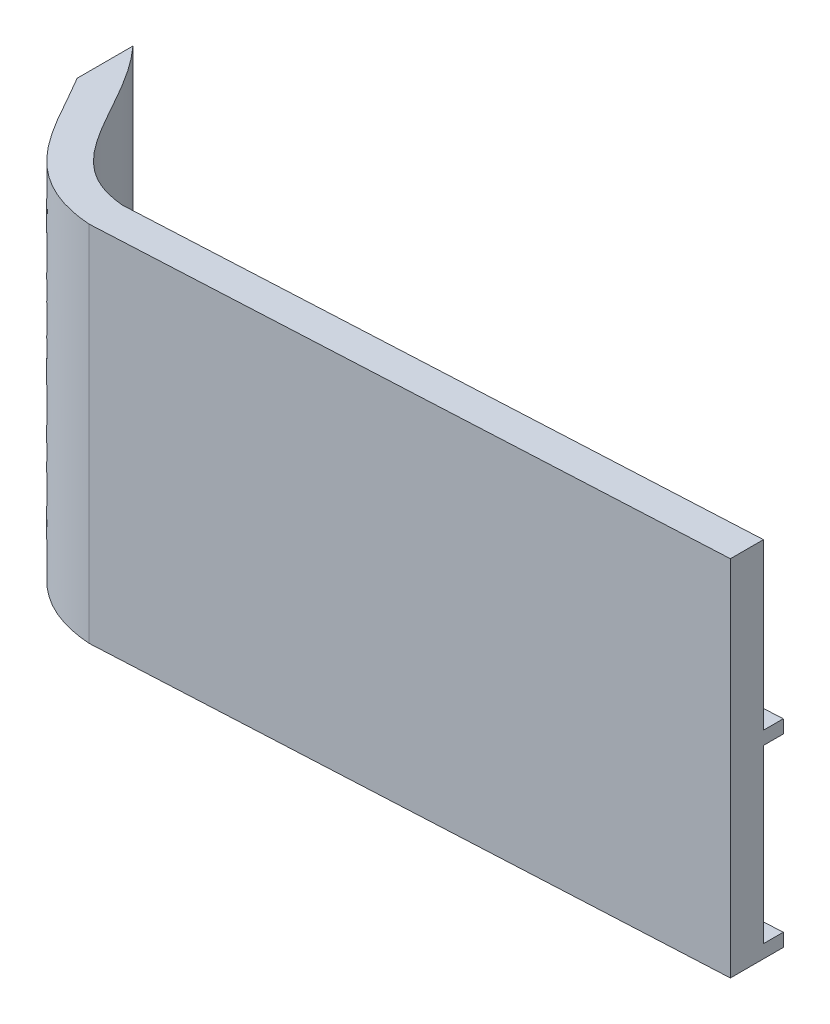
ISO-10303-21;
HEADER;
FILE_DESCRIPTION(('STEP AP214'),'2;1');
FILE_NAME('part.step','',(''),(''),'','','');
FILE_SCHEMA(('AUTOMOTIVE_DESIGN { 1 0 10303 214 1 1 1 1 }'));
ENDSEC;
DATA;
#1=APPLICATION_CONTEXT('core data for automotive mechanical design processes');
#2=APPLICATION_PROTOCOL_DEFINITION('international standard','automotive_design',2000,#1);
#3=PRODUCT_CONTEXT('',#1,'mechanical');
#4=PRODUCT('Part','Part','',(#3));
#5=PRODUCT_RELATED_PRODUCT_CATEGORY('part','',(#4));
#6=PRODUCT_DEFINITION_FORMATION('','',#4);
#7=PRODUCT_DEFINITION_CONTEXT('part definition',#1,'design');
#8=PRODUCT_DEFINITION('design','',#6,#7);
#9=PRODUCT_DEFINITION_SHAPE('','',#8);
#10=(LENGTH_UNIT() NAMED_UNIT(*) SI_UNIT(.MILLI.,.METRE.));
#11=(NAMED_UNIT(*) PLANE_ANGLE_UNIT() SI_UNIT($,.RADIAN.));
#12=(NAMED_UNIT(*) SI_UNIT($,.STERADIAN.) SOLID_ANGLE_UNIT());
#13=UNCERTAINTY_MEASURE_WITH_UNIT(LENGTH_MEASURE(1.E-05),#10,'distance_accuracy_value','');
#14=(GEOMETRIC_REPRESENTATION_CONTEXT(3) GLOBAL_UNCERTAINTY_ASSIGNED_CONTEXT((#13)) GLOBAL_UNIT_ASSIGNED_CONTEXT((#10,
#11,#12)) REPRESENTATION_CONTEXT('',''));
#15=CARTESIAN_POINT('',(0.,0.,0.));
#16=DIRECTION('',(0.,0.,1.));
#17=DIRECTION('',(1.,0.,0.));
#18=AXIS2_PLACEMENT_3D('',#15,#16,#17);
#19=CARTESIAN_POINT('',(15.2026066350711,-55.02,-53.3815975655058));
#20=DIRECTION('',(-1.,0.,0.));
#21=DIRECTION('',(0.,0.,1.));
#22=AXIS2_PLACEMENT_3D('',#19,#20,#21);
#23=PLANE('',#22);
#24=DIRECTION('',(0.,-1.,0.));
#25=VECTOR('',#24,1.);
#26=CARTESIAN_POINT('',(15.2026066350711,-55.,62.2678534896764));
#27=LINE('',#26,#25);
#28=CARTESIAN_POINT('',(15.2026066350711,0.,62.2678534896764));
#29=VERTEX_POINT('',#28);
#30=CARTESIAN_POINT('',(15.2026066350711,-55.,62.2678534896764));
#31=VERTEX_POINT('',#30);
#32=EDGE_CURVE('E249',#29,#31,#27,.T.);
#33=ORIENTED_EDGE('',*,*,#32,.T.);
#34=DIRECTION('',(0.,0.,-1.));
#35=VECTOR('',#34,1.);
#36=CARTESIAN_POINT('',(15.2026066350711,-55.,32.5431279620853));
#37=LINE('',#36,#35);
#38=CARTESIAN_POINT('',(15.2026066350711,-55.,54.2576414228439));
#39=VERTEX_POINT('',#38);
#40=EDGE_CURVE('E252',#31,#39,#37,.T.);
#41=ORIENTED_EDGE('',*,*,#40,.T.);
#42=DIRECTION('',(0.,-1.,0.));
#43=VECTOR('',#42,1.);
#44=CARTESIAN_POINT('',(15.2026066350711,0.,54.2576414228439));
#45=LINE('',#44,#43);
#46=CARTESIAN_POINT('',(15.2026066350711,-53.,54.2576414228439));
#47=VERTEX_POINT('',#46);
#48=EDGE_CURVE('E211',#47,#39,#45,.T.);
#49=ORIENTED_EDGE('',*,*,#48,.F.);
#50=DIRECTION('',(0.,0.,-1.));
#51=VECTOR('',#50,1.);
#52=CARTESIAN_POINT('',(15.2026066350711,-53.,54.7700862993215));
#53=LINE('',#52,#51);
#54=CARTESIAN_POINT('',(15.2026066350711,-53.,57.2614709479061));
#55=VERTEX_POINT('',#54);
#56=EDGE_CURVE('E248',#55,#47,#53,.T.);
#57=ORIENTED_EDGE('',*,*,#56,.F.);
#58=DIRECTION('',(0.,-1.,0.));
#59=VECTOR('',#58,1.);
#60=CARTESIAN_POINT('',(15.2026066350711,-55.,57.261470947906));
#61=LINE('',#60,#59);
#62=CARTESIAN_POINT('',(15.2026066350711,-27.,57.261470947906));
#63=VERTEX_POINT('',#62);
#64=EDGE_CURVE('E154',#63,#55,#61,.T.);
#65=ORIENTED_EDGE('',*,*,#64,.F.);
#66=DIRECTION('',(0.,0.,-1.));
#67=VECTOR('',#66,1.);
#68=CARTESIAN_POINT('',(15.2026066350711,-27.,54.7700862993215));
#69=LINE('',#68,#67);
#70=CARTESIAN_POINT('',(15.2026066350711,-27.,54.2576414228439));
#71=VERTEX_POINT('',#70);
#72=EDGE_CURVE('E43',#63,#71,#69,.T.);
#73=ORIENTED_EDGE('',*,*,#72,.T.);
#74=DIRECTION('',(0.,1.,0.));
#75=VECTOR('',#74,1.);
#76=CARTESIAN_POINT('',(15.2026066350711,0.,54.2576414228439));
#77=LINE('',#76,#75);
#78=CARTESIAN_POINT('',(15.2026066350711,-25.,54.2576414228439));
#79=VERTEX_POINT('',#78);
#80=EDGE_CURVE('E11',#71,#79,#77,.T.);
#81=ORIENTED_EDGE('',*,*,#80,.T.);
#82=DIRECTION('',(0.,0.,-1.));
#83=VECTOR('',#82,1.);
#84=CARTESIAN_POINT('',(15.2026066350711,-25.,54.7700862993215));
#85=LINE('',#84,#83);
#86=CARTESIAN_POINT('',(15.2026066350711,-25.,57.261470947906));
#87=VERTEX_POINT('',#86);
#88=EDGE_CURVE('E51',#87,#79,#85,.T.);
#89=ORIENTED_EDGE('',*,*,#88,.F.);
#90=CARTESIAN_POINT('',(15.2026066350711,0.,57.261470947906));
#91=VERTEX_POINT('',#90);
#92=EDGE_CURVE('E253',#91,#87,#61,.T.);
#93=ORIENTED_EDGE('',*,*,#92,.F.);
#94=DIRECTION('',(0.,0.,-1.));
#95=VECTOR('',#94,1.);
#96=CARTESIAN_POINT('',(15.2026066350711,0.,32.5431279620853));
#97=LINE('',#96,#95);
#98=EDGE_CURVE('E38',#29,#91,#97,.T.);
#99=ORIENTED_EDGE('',*,*,#98,.F.);
#100=EDGE_LOOP('',(#33,#41,#49,#57,#65,#73,#81,#89,#93,#99));
#101=FACE_BOUND('',#100,.T.);
#102=ADVANCED_FACE('F35',(#101),#23,.F.);
#103=CARTESIAN_POINT('',(-77.2973933649289,-55.,66.9431279620853));
#104=DIRECTION('',(0.0504790708541747,0.,0.998725119042121));
#105=DIRECTION('',(0.998725119042121,0.,-0.0504790708541747));
#106=AXIS2_PLACEMENT_3D('',#103,#104,#105);
#107=PLANE('',#106);
#108=ORIENTED_EDGE('',*,*,#32,.F.);
#109=DIRECTION('',(0.998725119042121,0.,-0.0504790708541747));
#110=VECTOR('',#109,1.);
#111=CARTESIAN_POINT('',(-77.2973933649289,0.,66.9431279620853));
#112=LINE('',#111,#110);
#113=CARTESIAN_POINT('',(-77.2973933649289,0.,66.9431279620853));
#114=VERTEX_POINT('',#113);
#115=EDGE_CURVE('E198',#114,#29,#112,.T.);
#116=ORIENTED_EDGE('',*,*,#115,.F.);
#117=DIRECTION('',(0.,1.,0.));
#118=VECTOR('',#117,1.);
#119=CARTESIAN_POINT('',(-77.2973933649289,-55.,66.9431279620853));
#120=LINE('',#119,#118);
#121=CARTESIAN_POINT('',(-77.2973933649289,-55.,66.9431279620853));
#122=VERTEX_POINT('',#121);
#123=EDGE_CURVE('E310',#122,#114,#120,.T.);
#124=ORIENTED_EDGE('',*,*,#123,.F.);
#125=DIRECTION('',(0.998725119042121,0.,-0.0504790708541747));
#126=VECTOR('',#125,1.);
#127=CARTESIAN_POINT('',(-77.2973933649289,-55.,66.9431279620853));
#128=LINE('',#127,#126);
#129=EDGE_CURVE('E193',#122,#31,#128,.T.);
#130=ORIENTED_EDGE('',*,*,#129,.T.);
#131=EDGE_LOOP('',(#108,#116,#124,#130));
#132=FACE_BOUND('',#131,.T.);
#133=ADVANCED_FACE('F328',(#132),#107,.T.);
#134=CARTESIAN_POINT('',(-77.2198387862858,-55.,61.9328255398636));
#135=DIRECTION('',(0.0504790708541748,0.,0.998725119042121));
#136=DIRECTION('',(0.998725119042121,0.,-0.0504790708541748));
#137=AXIS2_PLACEMENT_3D('',#134,#135,#136);
#138=PLANE('',#137);
#139=DIRECTION('',(0.998725119042121,0.,-0.0504790708541748));
#140=VECTOR('',#139,1.);
#141=CARTESIAN_POINT('',(-77.2198387862858,0.,61.9328255398636));
#142=LINE('',#141,#140);
#143=CARTESIAN_POINT('',(-77.2198387862858,0.,61.9328255398636));
#144=VERTEX_POINT('',#143);
#145=EDGE_CURVE('E197',#144,#91,#142,.T.);
#146=ORIENTED_EDGE('',*,*,#145,.T.);
#147=ORIENTED_EDGE('',*,*,#92,.T.);
#148=DIRECTION('',(0.998725119042121,0.,-0.0504790708541748));
#149=VECTOR('',#148,1.);
#150=CARTESIAN_POINT('',(-77.2198387862858,-25.,61.9328255398636));
#151=LINE('',#150,#149);
#152=CARTESIAN_POINT('',(5.21535544464991,-25.,57.7662616564478));
#153=VERTEX_POINT('',#152);
#154=EDGE_CURVE('E209',#153,#87,#151,.T.);
#155=ORIENTED_EDGE('',*,*,#154,.F.);
#156=DIRECTION('',(0.,1.,0.));
#157=VECTOR('',#156,1.);
#158=CARTESIAN_POINT('',(5.21535544464991,-27.,57.7662616564478));
#159=LINE('',#158,#157);
#160=CARTESIAN_POINT('',(5.21535544464991,-27.,57.7662616564478));
#161=VERTEX_POINT('',#160);
#162=EDGE_CURVE('E179',#161,#153,#159,.T.);
#163=ORIENTED_EDGE('',*,*,#162,.F.);
#164=DIRECTION('',(0.998725119042121,0.,-0.0504790708541748));
#165=VECTOR('',#164,1.);
#166=CARTESIAN_POINT('',(-77.2198387862858,-27.,61.9328255398636));
#167=LINE('',#166,#165);
#168=EDGE_CURVE('E207',#161,#63,#167,.T.);
#169=ORIENTED_EDGE('',*,*,#168,.T.);
#170=ORIENTED_EDGE('',*,*,#64,.T.);
#171=DIRECTION('',(0.998725119042121,0.,-0.0504790708541747));
#172=VECTOR('',#171,1.);
#173=CARTESIAN_POINT('',(5.21535544464991,-53.,57.7662616564478));
#174=LINE('',#173,#172);
#175=CARTESIAN_POINT('',(5.21535544464991,-53.,57.7662616564478));
#176=VERTEX_POINT('',#175);
#177=EDGE_CURVE('E135',#176,#55,#174,.T.);
#178=ORIENTED_EDGE('',*,*,#177,.F.);
#179=DIRECTION('',(0.,-1.,0.));
#180=VECTOR('',#179,1.);
#181=CARTESIAN_POINT('',(5.21535544464991,-53.,57.7662616564478));
#182=LINE('',#181,#180);
#183=CARTESIAN_POINT('',(5.21535544464991,-55.,57.7662616564478));
#184=VERTEX_POINT('',#183);
#185=EDGE_CURVE('E144',#176,#184,#182,.T.);
#186=ORIENTED_EDGE('',*,*,#185,.T.);
#187=DIRECTION('',(0.998725119042121,0.,-0.0504790708541748));
#188=VECTOR('',#187,1.);
#189=CARTESIAN_POINT('',(-77.2198387862858,-55.,61.9328255398636));
#190=LINE('',#189,#188);
#191=CARTESIAN_POINT('',(-77.2198387862858,-55.,61.9328255398636));
#192=VERTEX_POINT('',#191);
#193=EDGE_CURVE('E194',#192,#184,#190,.T.);
#194=ORIENTED_EDGE('',*,*,#193,.F.);
#195=DIRECTION('',(0.,1.,0.));
#196=VECTOR('',#195,1.);
#197=CARTESIAN_POINT('',(-77.2198387862858,-55.,61.9328255398636));
#198=LINE('',#197,#196);
#199=EDGE_CURVE('E264',#192,#144,#198,.T.);
#200=ORIENTED_EDGE('',*,*,#199,.T.);
#201=EDGE_LOOP('',(#146,#147,#155,#163,#169,#170,#178,#186,#194,#200));
#202=FACE_BOUND('',#201,.T.);
#203=ADVANCED_FACE('F151',(#202),#138,.F.);
#204=CARTESIAN_POINT('',(5.06391823208739,-53.,54.7700862993215));
#205=DIRECTION('',(-0.998725119042121,0.,0.0504790708541748));
#206=DIRECTION('',(0.0504790708541748,0.,0.998725119042121));
#207=AXIS2_PLACEMENT_3D('',#204,#205,#206);
#208=PLANE('',#207);
#209=ORIENTED_EDGE('',*,*,#185,.F.);
#210=DIRECTION('',(0.0504790708541748,0.,0.998725119042121));
#211=VECTOR('',#210,1.);
#212=CARTESIAN_POINT('',(5.06391823208739,-53.,54.7700862993215));
#213=LINE('',#212,#211);
#214=CARTESIAN_POINT('',(5.06391823208739,-53.,54.7700862993215));
#215=VERTEX_POINT('',#214);
#216=EDGE_CURVE('E131',#215,#176,#213,.T.);
#217=ORIENTED_EDGE('',*,*,#216,.F.);
#218=DIRECTION('',(0.,-1.,0.));
#219=VECTOR('',#218,1.);
#220=CARTESIAN_POINT('',(5.06391823208739,-53.,54.7700862993215));
#221=LINE('',#220,#219);
#222=CARTESIAN_POINT('',(5.06391823208739,-55.,54.7700862993215));
#223=VERTEX_POINT('',#222);
#224=EDGE_CURVE('E156',#215,#223,#221,.T.);
#225=ORIENTED_EDGE('',*,*,#224,.T.);
#226=DIRECTION('',(0.0504790708541748,0.,0.998725119042121));
#227=VECTOR('',#226,1.);
#228=CARTESIAN_POINT('',(5.06391823208739,-55.,54.7700862993215));
#229=LINE('',#228,#227);
#230=EDGE_CURVE('E141',#223,#184,#229,.T.);
#231=ORIENTED_EDGE('',*,*,#230,.T.);
#232=EDGE_LOOP('',(#209,#217,#225,#231));
#233=FACE_BOUND('',#232,.T.);
#234=ADVANCED_FACE('F145',(#233),#208,.T.);
#235=CARTESIAN_POINT('',(-115.897393364929,-55.,32.5431279620853));
#236=DIRECTION('',(0.,-1.,0.));
#237=DIRECTION('',(0.,0.,-1.));
#238=AXIS2_PLACEMENT_3D('',#235,#236,#237);
#239=PLANE('',#238);
#240=ORIENTED_EDGE('',*,*,#40,.F.);
#241=ORIENTED_EDGE('',*,*,#129,.F.);
#242=CARTESIAN_POINT('',(-112.297393364929,-55.,37.9431279620853));
#243=CARTESIAN_POINT('',(-92.6699085338428,-55.,40.1856361833209));
#244=CARTESIAN_POINT('',(-97.4782956804952,-55.,65.4447991108473));
#245=CARTESIAN_POINT('',(-77.2973933649289,-55.,66.9431279620853));
#246=B_SPLINE_CURVE_WITH_KNOTS('',3,(#242,#243,#244,#245),.UNSPECIFIED.,.F.,.F.,(4,4),(0.,1.),.UNSPECIFIED.);
#247=CARTESIAN_POINT('',(-97.2973933577952,-55.,48.7098659324555));
#248=VERTEX_POINT('',#247);
#249=EDGE_CURVE('E301',#248,#122,#246,.T.);
#250=ORIENTED_EDGE('',*,*,#249,.F.);
#251=DIRECTION('',(0.,0.,-1.));
#252=VECTOR('',#251,1.);
#253=CARTESIAN_POINT('',(-97.2973933577951,-55.,32.5431279620854));
#254=LINE('',#253,#252);
#255=CARTESIAN_POINT('',(-97.2973933649289,-55.,40.2586431743358));
#256=VERTEX_POINT('',#255);
#257=EDGE_CURVE('E168',#248,#256,#254,.T.);
#258=ORIENTED_EDGE('',*,*,#257,.T.);
#259=CARTESIAN_POINT('',(-77.2198387862858,-55.,61.9328255398636));
#260=CARTESIAN_POINT('',(-78.2107017584619,-55.,61.8435846098282));
#261=CARTESIAN_POINT('',(-79.1969605229184,-55.,61.6726700387196));
#262=CARTESIAN_POINT('',(-80.6118955307622,-55.,61.2559322589059));
#263=CARTESIAN_POINT('',(-81.0738075363474,-55.,61.0902721397558));
#264=CARTESIAN_POINT('',(-81.9757491725826,-55.,60.698816324706));
#265=CARTESIAN_POINT('',(-82.4171226794675,-55.,60.4721016558839));
#266=CARTESIAN_POINT('',(-83.6970629718621,-55.,59.6999601025132));
#267=CARTESIAN_POINT('',(-84.461423347136,-55.,59.0809836088541));
#268=CARTESIAN_POINT('',(-85.5106781349921,-55.,58.0385154706328));
#269=CARTESIAN_POINT('',(-85.8453115285959,-55.,57.6709972577795));
#270=CARTESIAN_POINT('',(-86.4839082331669,-55.,56.9114729422574));
#271=CARTESIAN_POINT('',(-86.7871648693087,-55.,56.5206426243169));
#272=CARTESIAN_POINT('',(-87.6614057532498,-55.,55.3236380255405));
#273=CARTESIAN_POINT('',(-88.1973862119224,-55.,54.493312491717));
#274=CARTESIAN_POINT('',(-89.2240136923505,-55.,52.8013831158895));
#275=CARTESIAN_POINT('',(-89.7142600627695,-55.,51.9396796712163));
#276=CARTESIAN_POINT('',(-91.1675589427809,-55.,49.344344007152));
#277=CARTESIAN_POINT('',(-92.1149811469364,-55.,47.6003319069548));
#278=CARTESIAN_POINT('',(-94.1801021089176,-55.,44.2217956485791));
#279=CARTESIAN_POINT('',(-95.2960430904192,-55.,42.5861412390059));
#280=CARTESIAN_POINT('',(-96.8184655607454,-55.,40.791519394526));
#281=CARTESIAN_POINT('',(-97.055392698968,-55.,40.5225433078804));
#282=CARTESIAN_POINT('',(-97.2973933649289,-55.,40.2586431743359));
#283=B_SPLINE_CURVE_WITH_KNOTS('',3,(#259,#260,#261,#262,#263,#264,#265,#266,#267,#268,#269,
#270,#271,#272,#273,#274,#275,#276,#277,#278,#279,#280,#281,#282),.UNSPECIFIED.,.F.,.F.,(4,2,2,
2,2,2,2,2,2,2,2,4),(0.352672192174137,0.415172192174137,0.446422192174137,0.477672192174137,
0.540172192174136,0.571422192174136,0.602672192174136,0.665172192174136,0.727672192174136,
0.852672192174136,0.977672192174136,1.),.UNSPECIFIED.);
#284=EDGE_CURVE('E271',#256,#192,#283,.F.);
#285=ORIENTED_EDGE('',*,*,#284,.T.);
#286=ORIENTED_EDGE('',*,*,#193,.T.);
#287=ORIENTED_EDGE('',*,*,#230,.F.);
#288=DIRECTION('',(0.998725119042121,0.,-0.0504790708541747));
#289=VECTOR('',#288,1.);
#290=CARTESIAN_POINT('',(5.06391823208739,-55.,54.7700862993215));
#291=LINE('',#290,#289);
#292=EDGE_CURVE('E158',#223,#39,#291,.T.);
#293=ORIENTED_EDGE('',*,*,#292,.T.);
#294=EDGE_LOOP('',(#240,#241,#250,#258,#285,#286,#287,#293));
#295=FACE_BOUND('',#294,.T.);
#296=ADVANCED_FACE('F233',(#295),#239,.T.);
#297=CARTESIAN_POINT('',(5.06391823208739,-53.,54.7700862993215));
#298=DIRECTION('',(0.,-1.,0.));
#299=DIRECTION('',(0.,0.,-1.));
#300=AXIS2_PLACEMENT_3D('',#297,#298,#299);
#301=PLANE('',#300);
#302=ORIENTED_EDGE('',*,*,#177,.T.);
#303=ORIENTED_EDGE('',*,*,#56,.T.);
#304=DIRECTION('',(0.998725119042121,0.,-0.0504790708541747));
#305=VECTOR('',#304,1.);
#306=CARTESIAN_POINT('',(5.06391823208739,-53.,54.7700862993215));
#307=LINE('',#306,#305);
#308=EDGE_CURVE('E137',#215,#47,#307,.T.);
#309=ORIENTED_EDGE('',*,*,#308,.F.);
#310=ORIENTED_EDGE('',*,*,#216,.T.);
#311=EDGE_LOOP('',(#302,#303,#309,#310));
#312=FACE_BOUND('',#311,.T.);
#313=ADVANCED_FACE('F133',(#312),#301,.F.);
#314=CARTESIAN_POINT('',(2.77412190406091,0.,54.88582063791));
#315=DIRECTION('',(0.0504790708541748,0.,0.998725119042121));
#316=DIRECTION('',(0.998725119042121,0.,-0.0504790708541748));
#317=AXIS2_PLACEMENT_3D('',#314,#315,#316);
#318=PLANE('',#317);
#319=ORIENTED_EDGE('',*,*,#308,.T.);
#320=ORIENTED_EDGE('',*,*,#48,.T.);
#321=ORIENTED_EDGE('',*,*,#292,.F.);
#322=ORIENTED_EDGE('',*,*,#224,.F.);
#323=EDGE_LOOP('',(#319,#320,#321,#322));
#324=FACE_BOUND('',#323,.T.);
#325=ADVANCED_FACE('F232',(#324),#318,.F.);
#326=CARTESIAN_POINT('',(-115.897393364929,0.,32.5431279620853));
#327=DIRECTION('',(0.,-1.,0.));
#328=DIRECTION('',(0.,0.,-1.));
#329=AXIS2_PLACEMENT_3D('',#326,#327,#328);
#330=PLANE('',#329);
#331=ORIENTED_EDGE('',*,*,#115,.T.);
#332=ORIENTED_EDGE('',*,*,#98,.T.);
#333=ORIENTED_EDGE('',*,*,#145,.F.);
#334=CARTESIAN_POINT('',(-97.2973933649289,0.,40.2586431743359));
#335=CARTESIAN_POINT('',(-97.055392698968,0.,40.5225433078804));
#336=CARTESIAN_POINT('',(-96.8184655607454,0.,40.791519394526));
#337=CARTESIAN_POINT('',(-95.2960430904192,0.,42.5861412390059));
#338=CARTESIAN_POINT('',(-94.1801021089176,0.,44.2217956485791));
#339=CARTESIAN_POINT('',(-92.1149811469364,0.,47.6003319069548));
#340=CARTESIAN_POINT('',(-91.1675589427809,0.,49.344344007152));
#341=CARTESIAN_POINT('',(-89.7142600627695,0.,51.9396796712163));
#342=CARTESIAN_POINT('',(-89.2240136923505,0.,52.8013831158895));
#343=CARTESIAN_POINT('',(-88.1973862119224,0.,54.493312491717));
#344=CARTESIAN_POINT('',(-87.6614057532498,0.,55.3236380255405));
#345=CARTESIAN_POINT('',(-86.7871648693087,0.,56.5206426243169));
#346=CARTESIAN_POINT('',(-86.4839082331669,0.,56.9114729422574));
#347=CARTESIAN_POINT('',(-85.8453115285959,0.,57.6709972577795));
#348=CARTESIAN_POINT('',(-85.5106781349921,0.,58.0385154706328));
#349=CARTESIAN_POINT('',(-84.461423347136,0.,59.0809836088541));
#350=CARTESIAN_POINT('',(-83.6970629718621,0.,59.6999601025132));
#351=CARTESIAN_POINT('',(-82.4171226794675,0.,60.4721016558839));
#352=CARTESIAN_POINT('',(-81.9757491725826,0.,60.698816324706));
#353=CARTESIAN_POINT('',(-81.0738075363474,0.,61.0902721397558));
#354=CARTESIAN_POINT('',(-80.6118955307622,0.,61.2559322589059));
#355=CARTESIAN_POINT('',(-79.1969605229184,0.,61.6726700387196));
#356=CARTESIAN_POINT('',(-78.2107017584619,0.,61.8435846098282));
#357=CARTESIAN_POINT('',(-77.2198387862858,0.,61.9328255398636));
#358=B_SPLINE_CURVE_WITH_KNOTS('',3,(#334,#335,#336,#337,#338,#339,#340,#341,#342,#343,#344,
#345,#346,#347,#348,#349,#350,#351,#352,#353,#354,#355,#356,#357),.UNSPECIFIED.,.F.,.F.,(4,2,2,
2,2,2,2,2,2,2,2,4),(0.352672192174137,0.375000000000001,0.500000000000001,0.625000000000001,
0.687500000000001,0.750000000000001,0.781250000000001,0.812500000000001,0.875000000000001,
0.90625,0.9375,1.),.UNSPECIFIED.);
#359=CARTESIAN_POINT('',(-97.2973933649289,0.,40.2586431743358));
#360=VERTEX_POINT('',#359);
#361=EDGE_CURVE('E187',#360,#144,#358,.T.);
#362=ORIENTED_EDGE('',*,*,#361,.F.);
#363=DIRECTION('',(0.,0.,-1.));
#364=VECTOR('',#363,1.);
#365=CARTESIAN_POINT('',(-97.2973933577951,0.,32.5431279620854));
#366=LINE('',#365,#364);
#367=CARTESIAN_POINT('',(-97.2973933480436,0.,48.7098659485531));
#368=VERTEX_POINT('',#367);
#369=EDGE_CURVE('E148',#368,#360,#366,.T.);
#370=ORIENTED_EDGE('',*,*,#369,.F.);
#371=CARTESIAN_POINT('',(-112.297393364929,0.,37.9431279620853));
#372=CARTESIAN_POINT('',(-92.6699085338428,0.,40.1856361833209));
#373=CARTESIAN_POINT('',(-97.4782956804952,0.,65.4447991108473));
#374=CARTESIAN_POINT('',(-77.2973933649289,0.,66.9431279620853));
#375=B_SPLINE_CURVE_WITH_KNOTS('',3,(#371,#372,#373,#374),.UNSPECIFIED.,.F.,.F.,(4,4),(0.,1.),.UNSPECIFIED.);
#376=EDGE_CURVE('E268',#368,#114,#375,.T.);
#377=ORIENTED_EDGE('',*,*,#376,.T.);
#378=EDGE_LOOP('',(#331,#332,#333,#362,#370,#377));
#379=FACE_BOUND('',#378,.T.);
#380=ADVANCED_FACE('F222',(#379),#330,.F.);
#381=CARTESIAN_POINT('',(-112.012685813725,-55.,32.9431279620853));
#382=CARTESIAN_POINT('',(-111.76393203467,-55.,32.971548944162));
#383=CARTESIAN_POINT('',(-111.515094868064,-55.,32.9996771672604));
#384=CARTESIAN_POINT('',(-111.019935831522,-55.,33.0647643763139));
#385=CARTESIAN_POINT('',(-110.280056378445,-55.,33.1724329916909));
#386=CARTESIAN_POINT('',(-109.548971297023,-55.,33.3109770944547));
#387=CARTESIAN_POINT('',(-108.099127201398,-55.,33.6313399474389));
#388=CARTESIAN_POINT('',(-107.148988267628,-55.,33.9025762353226));
#389=CARTESIAN_POINT('',(-105.750985585403,-55.,34.4049451449487));
#390=CARTESIAN_POINT('',(-105.289521584022,-55.,34.5883296780118));
#391=CARTESIAN_POINT('',(-104.376130888393,-55.,34.9885825469255));
#392=CARTESIAN_POINT('',(-103.922465099996,-55.,35.206387961919));
#393=CARTESIAN_POINT('',(-102.589388008658,-55.,35.9056985522348));
#394=CARTESIAN_POINT('',(-101.744581034289,-55.,36.4289061192694));
#395=CARTESIAN_POINT('',(-100.1370714003,-55.,37.5818999769299));
#396=CARTESIAN_POINT('',(-99.374406226542,-55.,38.211734927548));
#397=CARTESIAN_POINT('',(-98.2870248596875,-55.,39.229980482334));
#398=CARTESIAN_POINT('',(-97.9339894172788,-55.,39.5816301750441));
#399=CARTESIAN_POINT('',(-97.245735069553,-55.,40.3080570147017));
#400=CARTESIAN_POINT('',(-96.9106636735859,-55.,40.6828368503909));
#401=CARTESIAN_POINT('',(-95.2960430904192,-55.,42.5861412390059));
#402=CARTESIAN_POINT('',(-94.1801021089176,-55.,44.2217956485791));
#403=CARTESIAN_POINT('',(-92.1149811469364,-55.,47.6003319069548));
#404=CARTESIAN_POINT('',(-91.1675589427809,-55.,49.344344007152));
#405=CARTESIAN_POINT('',(-89.7142600627695,-55.,51.9396796712163));
#406=CARTESIAN_POINT('',(-89.2240136923505,-55.,52.8013831158895));
#407=CARTESIAN_POINT('',(-88.1973862119224,-55.,54.493312491717));
#408=CARTESIAN_POINT('',(-87.6614057532498,-55.,55.3236380255405));
#409=CARTESIAN_POINT('',(-86.7871648693087,-55.,56.5206426243169));
#410=CARTESIAN_POINT('',(-86.4839082331669,-55.,56.9114729422574));
#411=CARTESIAN_POINT('',(-85.8453115285959,-55.,57.6709972577795));
#412=CARTESIAN_POINT('',(-85.5106781349921,-55.,58.0385154706328));
#413=CARTESIAN_POINT('',(-84.461423347136,-55.,59.0809836088541));
#414=CARTESIAN_POINT('',(-83.6970629718621,-55.,59.6999601025132));
#415=CARTESIAN_POINT('',(-82.4171226794675,-55.,60.4721016558839));
#416=CARTESIAN_POINT('',(-81.9757491725826,-55.,60.698816324706));
#417=CARTESIAN_POINT('',(-81.0738075363474,-55.,61.0902721397558));
#418=CARTESIAN_POINT('',(-80.6118955307622,-55.,61.2559322589059));
#419=CARTESIAN_POINT('',(-79.1969605229184,-55.,61.6726700387196));
#420=CARTESIAN_POINT('',(-78.2107017584619,-55.,61.8435846098282));
#421=CARTESIAN_POINT('',(-77.2198387862858,-55.,61.9328255398636));
#422=B_SPLINE_CURVE_WITH_KNOTS('',3,(#381,#382,#383,#384,#385,#386,#387,#388,#389,#390,#391,
#392,#393,#394,#395,#396,#397,#398,#399,#400,#401,#402,#403,#404,#405,#406,#407,#408,#409,#410,
#411,#412,#413,#414,#415,#416,#417,#418,#419,#420,#421),.UNSPECIFIED.,.F.,.F.,(4,2,1,2,2,2,2,2,
2,2,2,2,2,2,2,2,2,2,2,2,4),(0.,0.0156250000000002,0.0312500000000003,0.0625000000000006,
0.125000000000001,0.156250000000001,0.187500000000002,0.250000000000001,0.312500000000001,
0.343750000000001,0.375000000000001,0.500000000000001,0.625000000000001,0.687500000000001,
0.750000000000001,0.781250000000001,0.812500000000001,0.875000000000001,0.90625,0.9375,1.),.UNSPECIFIED.);
#423=DIRECTION('',(0.,1.,0.));
#424=VECTOR('',#423,1.);
#425=SURFACE_OF_LINEAR_EXTRUSION('',#422,#424);
#426=ORIENTED_EDGE('',*,*,#361,.T.);
#427=ORIENTED_EDGE('',*,*,#199,.F.);
#428=ORIENTED_EDGE('',*,*,#284,.F.);
#429=DIRECTION('',(0.,1.,0.));
#430=VECTOR('',#429,1.);
#431=CARTESIAN_POINT('',(-97.2973933649289,-55.,40.2586431743358));
#432=LINE('',#431,#430);
#433=EDGE_CURVE('E267',#256,#360,#432,.T.);
#434=ORIENTED_EDGE('',*,*,#433,.T.);
#435=EDGE_LOOP('',(#426,#427,#428,#434));
#436=FACE_BOUND('',#435,.T.);
#437=ADVANCED_FACE('F231',(#436),#425,.F.);
#438=DIRECTION('',(0.,1.,0.));
#439=VECTOR('',#438,1.);
#440=SURFACE_OF_LINEAR_EXTRUSION('',#246,#439);
#441=ORIENTED_EDGE('',*,*,#376,.F.);
#442=DIRECTION('',(0.,1.,0.));
#443=VECTOR('',#442,1.);
#444=CARTESIAN_POINT('',(-97.2973933577952,-55.,48.7098659324555));
#445=LINE('',#444,#443);
#446=EDGE_CURVE('E317',#368,#248,#445,.F.);
#447=ORIENTED_EDGE('',*,*,#446,.T.);
#448=ORIENTED_EDGE('',*,*,#249,.T.);
#449=ORIENTED_EDGE('',*,*,#123,.T.);
#450=EDGE_LOOP('',(#441,#447,#448,#449));
#451=FACE_BOUND('',#450,.T.);
#452=ADVANCED_FACE('F293',(#451),#440,.T.);
#453=CARTESIAN_POINT('',(5.06391823208738,-25.,54.7700862993215));
#454=DIRECTION('',(0.,-1.,0.));
#455=DIRECTION('',(0.,0.,-1.));
#456=AXIS2_PLACEMENT_3D('',#453,#454,#455);
#457=PLANE('',#456);
#458=ORIENTED_EDGE('',*,*,#154,.T.);
#459=ORIENTED_EDGE('',*,*,#88,.T.);
#460=DIRECTION('',(0.998725119042121,0.,-0.0504790708541747));
#461=VECTOR('',#460,1.);
#462=CARTESIAN_POINT('',(5.06391823208738,-25.,54.7700862993215));
#463=LINE('',#462,#461);
#464=CARTESIAN_POINT('',(5.06391823208738,-25.,54.7700862993215));
#465=VERTEX_POINT('',#464);
#466=EDGE_CURVE('E178',#465,#79,#463,.T.);
#467=ORIENTED_EDGE('',*,*,#466,.F.);
#468=DIRECTION('',(0.0504790708541748,0.,0.998725119042121));
#469=VECTOR('',#468,1.);
#470=CARTESIAN_POINT('',(5.06391823208738,-25.,54.7700862993215));
#471=LINE('',#470,#469);
#472=EDGE_CURVE('E190',#465,#153,#471,.T.);
#473=ORIENTED_EDGE('',*,*,#472,.T.);
#474=EDGE_LOOP('',(#458,#459,#467,#473));
#475=FACE_BOUND('',#474,.T.);
#476=ADVANCED_FACE('F356',(#475),#457,.F.);
#477=CARTESIAN_POINT('',(5.06391823208739,-27.,54.7700862993215));
#478=DIRECTION('',(0.998725119042121,0.,-0.0504790708541748));
#479=DIRECTION('',(-0.0504790708541748,0.,-0.998725119042121));
#480=AXIS2_PLACEMENT_3D('',#477,#478,#479);
#481=PLANE('',#480);
#482=ORIENTED_EDGE('',*,*,#162,.T.);
#483=ORIENTED_EDGE('',*,*,#472,.F.);
#484=DIRECTION('',(0.,1.,0.));
#485=VECTOR('',#484,1.);
#486=CARTESIAN_POINT('',(5.06391823208739,-27.,54.7700862993215));
#487=LINE('',#486,#485);
#488=CARTESIAN_POINT('',(5.06391823208739,-27.,54.7700862993215));
#489=VERTEX_POINT('',#488);
#490=EDGE_CURVE('E175',#489,#465,#487,.T.);
#491=ORIENTED_EDGE('',*,*,#490,.F.);
#492=DIRECTION('',(0.0504790708541748,0.,0.998725119042121));
#493=VECTOR('',#492,1.);
#494=CARTESIAN_POINT('',(5.06391823208739,-27.,54.7700862993215));
#495=LINE('',#494,#493);
#496=EDGE_CURVE('E184',#489,#161,#495,.T.);
#497=ORIENTED_EDGE('',*,*,#496,.T.);
#498=EDGE_LOOP('',(#482,#483,#491,#497));
#499=FACE_BOUND('',#498,.T.);
#500=ADVANCED_FACE('F354',(#499),#481,.F.);
#501=CARTESIAN_POINT('',(5.06391823208739,-27.,54.7700862993215));
#502=DIRECTION('',(0.,-1.,0.));
#503=DIRECTION('',(0.,0.,-1.));
#504=AXIS2_PLACEMENT_3D('',#501,#502,#503);
#505=PLANE('',#504);
#506=ORIENTED_EDGE('',*,*,#72,.F.);
#507=ORIENTED_EDGE('',*,*,#168,.F.);
#508=ORIENTED_EDGE('',*,*,#496,.F.);
#509=DIRECTION('',(0.998725119042121,0.,-0.0504790708541747));
#510=VECTOR('',#509,1.);
#511=CARTESIAN_POINT('',(5.06391823208739,-27.,54.7700862993215));
#512=LINE('',#511,#510);
#513=EDGE_CURVE('E181',#489,#71,#512,.T.);
#514=ORIENTED_EDGE('',*,*,#513,.T.);
#515=EDGE_LOOP('',(#506,#507,#508,#514));
#516=FACE_BOUND('',#515,.T.);
#517=ADVANCED_FACE('F349',(#516),#505,.T.);
#518=CARTESIAN_POINT('',(2.7741219040609,0.,54.88582063791));
#519=DIRECTION('',(-0.0504790708541747,0.,-0.998725119042121));
#520=DIRECTION('',(-0.998725119042121,0.,0.0504790708541747));
#521=AXIS2_PLACEMENT_3D('',#518,#519,#520);
#522=PLANE('',#521);
#523=ORIENTED_EDGE('',*,*,#80,.F.);
#524=ORIENTED_EDGE('',*,*,#513,.F.);
#525=ORIENTED_EDGE('',*,*,#490,.T.);
#526=ORIENTED_EDGE('',*,*,#466,.T.);
#527=EDGE_LOOP('',(#523,#524,#525,#526));
#528=FACE_BOUND('',#527,.T.);
#529=ADVANCED_FACE('F345',(#528),#522,.T.);
#530=CARTESIAN_POINT('',(-97.2973933577945,-55.02,-39.823610008286));
#531=DIRECTION('',(-1.,0.,0.));
#532=DIRECTION('',(0.,0.,1.));
#533=AXIS2_PLACEMENT_3D('',#530,#531,#532);
#534=PLANE('',#533);
#535=ORIENTED_EDGE('',*,*,#257,.F.);
#536=ORIENTED_EDGE('',*,*,#446,.F.);
#537=ORIENTED_EDGE('',*,*,#369,.T.);
#538=ORIENTED_EDGE('',*,*,#433,.F.);
#539=EDGE_LOOP('',(#535,#536,#537,#538));
#540=FACE_BOUND('',#539,.T.);
#541=ADVANCED_FACE('F331',(#540),#534,.T.);
#542=CLOSED_SHELL('',(#102,#133,#203,#234,#296,#313,#325,#380,#437,#452,#476,#500,#517,#529,#541));
#543=MANIFOLD_SOLID_BREP('B2',#542);
#544=ADVANCED_BREP_SHAPE_REPRESENTATION('',(#18,#543),#14);
#545=SHAPE_DEFINITION_REPRESENTATION(#9,#544);
ENDSEC;
END-ISO-10303-21;
